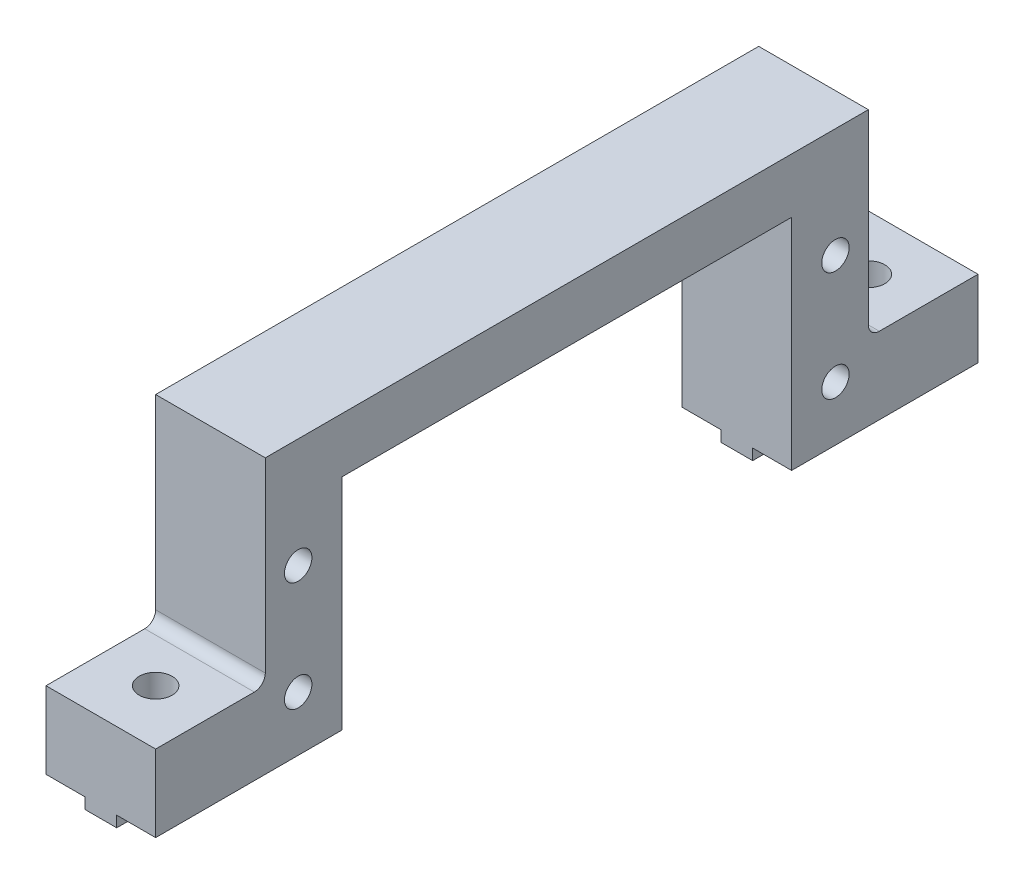
ISO-10303-21;
HEADER;
FILE_DESCRIPTION(('STEP AP214'),'2;1');
FILE_NAME('part.step','',(''),(''),'','','');
FILE_SCHEMA(('AUTOMOTIVE_DESIGN { 1 0 10303 214 1 1 1 1 }'));
ENDSEC;
DATA;
#1=APPLICATION_CONTEXT('core data for automotive mechanical design processes');
#2=APPLICATION_PROTOCOL_DEFINITION('international standard','automotive_design',2000,#1);
#3=PRODUCT_CONTEXT('',#1,'mechanical');
#4=PRODUCT('Part','Part','',(#3));
#5=PRODUCT_RELATED_PRODUCT_CATEGORY('part','',(#4));
#6=PRODUCT_DEFINITION_FORMATION('','',#4);
#7=PRODUCT_DEFINITION_CONTEXT('part definition',#1,'design');
#8=PRODUCT_DEFINITION('design','',#6,#7);
#9=PRODUCT_DEFINITION_SHAPE('','',#8);
#10=(LENGTH_UNIT() NAMED_UNIT(*) SI_UNIT(.MILLI.,.METRE.));
#11=(NAMED_UNIT(*) PLANE_ANGLE_UNIT() SI_UNIT($,.RADIAN.));
#12=(NAMED_UNIT(*) SI_UNIT($,.STERADIAN.) SOLID_ANGLE_UNIT());
#13=UNCERTAINTY_MEASURE_WITH_UNIT(LENGTH_MEASURE(1.E-05),#10,'distance_accuracy_value','');
#14=(GEOMETRIC_REPRESENTATION_CONTEXT(3) GLOBAL_UNCERTAINTY_ASSIGNED_CONTEXT((#13)) GLOBAL_UNIT_ASSIGNED_CONTEXT((#10,
#11,#12)) REPRESENTATION_CONTEXT('',''));
#15=CARTESIAN_POINT('',(0.,0.,0.));
#16=DIRECTION('',(0.,0.,1.));
#17=DIRECTION('',(1.,0.,0.));
#18=AXIS2_PLACEMENT_3D('',#15,#16,#17);
#19=CARTESIAN_POINT('',(-1.45,-1.,37.5));
#20=DIRECTION('',(1.,0.,0.));
#21=DIRECTION('',(0.,0.,-1.));
#22=AXIS2_PLACEMENT_3D('',#19,#20,#21);
#23=PLANE('',#22);
#24=DIRECTION('',(0.,0.,-1.));
#25=VECTOR('',#24,1.);
#26=CARTESIAN_POINT('',(-1.45,-1.,37.5));
#27=LINE('',#26,#25);
#28=CARTESIAN_POINT('',(-1.45,-1.,32.1159427126066));
#29=VERTEX_POINT('',#28);
#30=CARTESIAN_POINT('',(-1.45,-1.,20.5));
#31=VERTEX_POINT('',#30);
#32=EDGE_CURVE('E261',#29,#31,#27,.T.);
#33=ORIENTED_EDGE('',*,*,#32,.F.);
#34=DIRECTION('',(0.,1.,0.));
#35=VECTOR('',#34,1.);
#36=CARTESIAN_POINT('',(-1.45,-1.,32.1159427126066));
#37=LINE('',#36,#35);
#38=CARTESIAN_POINT('',(-1.45,0.,32.1159427126066));
#39=VERTEX_POINT('',#38);
#40=EDGE_CURVE('E455',#29,#39,#37,.T.);
#41=ORIENTED_EDGE('',*,*,#40,.T.);
#42=DIRECTION('',(0.,0.,-1.));
#43=VECTOR('',#42,1.);
#44=CARTESIAN_POINT('',(-1.45,0.,37.5));
#45=LINE('',#44,#43);
#46=CARTESIAN_POINT('',(-1.45,0.,20.5));
#47=VERTEX_POINT('',#46);
#48=EDGE_CURVE('E514',#39,#47,#45,.T.);
#49=ORIENTED_EDGE('',*,*,#48,.T.);
#50=DIRECTION('',(0.,-1.,0.));
#51=VECTOR('',#50,1.);
#52=CARTESIAN_POINT('',(-1.45,-1.,20.5));
#53=LINE('',#52,#51);
#54=EDGE_CURVE('E341',#47,#31,#53,.T.);
#55=ORIENTED_EDGE('',*,*,#54,.T.);
#56=EDGE_LOOP('',(#33,#41,#49,#55));
#57=FACE_BOUND('',#56,.T.);
#58=ADVANCED_FACE('F33',(#57),#23,.F.);
#59=CARTESIAN_POINT('',(1.45,-1.,37.5));
#60=DIRECTION('',(0.,1.,0.));
#61=DIRECTION('',(-1.,0.,0.));
#62=AXIS2_PLACEMENT_3D('',#59,#60,#61);
#63=PLANE('',#62);
#64=CARTESIAN_POINT('',(-1.45,-1.,37.5));
#65=VERTEX_POINT('',#64);
#66=CARTESIAN_POINT('',(-1.45,-1.,32.8840572873934));
#67=VERTEX_POINT('',#66);
#68=EDGE_CURVE('E249',#65,#67,#27,.T.);
#69=ORIENTED_EDGE('',*,*,#68,.T.);
#70=CARTESIAN_POINT('',(0.,-1.,32.5));
#71=DIRECTION('',(0.,1.,0.));
#72=DIRECTION('',(0.,0.,1.));
#73=AXIS2_PLACEMENT_3D('',#70,#71,#72);
#74=CIRCLE('',#73,1.5);
#75=CARTESIAN_POINT('',(1.45,-1.,32.8840572873934));
#76=VERTEX_POINT('',#75);
#77=EDGE_CURVE('E230',#67,#76,#74,.T.);
#78=ORIENTED_EDGE('',*,*,#77,.T.);
#79=DIRECTION('',(0.,0.,-1.));
#80=VECTOR('',#79,1.);
#81=CARTESIAN_POINT('',(1.45,-1.,37.5));
#82=LINE('',#81,#80);
#83=CARTESIAN_POINT('',(1.45,-1.,37.5));
#84=VERTEX_POINT('',#83);
#85=EDGE_CURVE('E246',#84,#76,#82,.T.);
#86=ORIENTED_EDGE('',*,*,#85,.F.);
#87=DIRECTION('',(1.,0.,0.));
#88=VECTOR('',#87,1.);
#89=CARTESIAN_POINT('',(1.45,-1.,37.5));
#90=LINE('',#89,#88);
#91=EDGE_CURVE('E333',#65,#84,#90,.T.);
#92=ORIENTED_EDGE('',*,*,#91,.F.);
#93=EDGE_LOOP('',(#69,#78,#86,#92));
#94=FACE_BOUND('',#93,.T.);
#95=ADVANCED_FACE('F244',(#94),#63,.F.);
#96=CARTESIAN_POINT('',(1.45,0.,37.5));
#97=DIRECTION('',(-1.,0.,0.));
#98=DIRECTION('',(0.,0.,1.));
#99=AXIS2_PLACEMENT_3D('',#96,#97,#98);
#100=PLANE('',#99);
#101=ORIENTED_EDGE('',*,*,#85,.T.);
#102=DIRECTION('',(0.,1.,0.));
#103=VECTOR('',#102,1.);
#104=CARTESIAN_POINT('',(1.45,-1.,32.8840572873934));
#105=LINE('',#104,#103);
#106=CARTESIAN_POINT('',(1.45,0.,32.8840572873934));
#107=VERTEX_POINT('',#106);
#108=EDGE_CURVE('E227',#76,#107,#105,.T.);
#109=ORIENTED_EDGE('',*,*,#108,.T.);
#110=DIRECTION('',(0.,0.,-1.));
#111=VECTOR('',#110,1.);
#112=CARTESIAN_POINT('',(1.45,0.,37.5));
#113=LINE('',#112,#111);
#114=CARTESIAN_POINT('',(1.45,0.,37.5));
#115=VERTEX_POINT('',#114);
#116=EDGE_CURVE('E269',#115,#107,#113,.T.);
#117=ORIENTED_EDGE('',*,*,#116,.F.);
#118=DIRECTION('',(0.,1.,0.));
#119=VECTOR('',#118,1.);
#120=CARTESIAN_POINT('',(1.45,0.,37.5));
#121=LINE('',#120,#119);
#122=EDGE_CURVE('E254',#84,#115,#121,.T.);
#123=ORIENTED_EDGE('',*,*,#122,.F.);
#124=EDGE_LOOP('',(#101,#109,#117,#123));
#125=FACE_BOUND('',#124,.T.);
#126=ADVANCED_FACE('F253',(#125),#100,.F.);
#127=CARTESIAN_POINT('',(-1.45,-1.,-32.8840572873934));
#128=VERTEX_POINT('',#127);
#129=CARTESIAN_POINT('',(-1.45,-1.,-37.5));
#130=VERTEX_POINT('',#129);
#131=EDGE_CURVE('E255',#128,#130,#27,.T.);
#132=ORIENTED_EDGE('',*,*,#131,.F.);
#133=DIRECTION('',(0.,1.,0.));
#134=VECTOR('',#133,1.);
#135=CARTESIAN_POINT('',(-1.45,-1.,-32.8840572873934));
#136=LINE('',#135,#134);
#137=CARTESIAN_POINT('',(-1.45,0.,-32.8840572873934));
#138=VERTEX_POINT('',#137);
#139=EDGE_CURVE('E430',#128,#138,#136,.T.);
#140=ORIENTED_EDGE('',*,*,#139,.T.);
#141=CARTESIAN_POINT('',(-1.45,0.,-37.5));
#142=VERTEX_POINT('',#141);
#143=EDGE_CURVE('E516',#138,#142,#45,.T.);
#144=ORIENTED_EDGE('',*,*,#143,.T.);
#145=DIRECTION('',(0.,-1.,0.));
#146=VECTOR('',#145,1.);
#147=CARTESIAN_POINT('',(-1.45,-1.,-37.5));
#148=LINE('',#147,#146);
#149=EDGE_CURVE('E318',#142,#130,#148,.T.);
#150=ORIENTED_EDGE('',*,*,#149,.T.);
#151=EDGE_LOOP('',(#132,#140,#144,#150));
#152=FACE_BOUND('',#151,.T.);
#153=ADVANCED_FACE('F534',(#152),#23,.F.);
#154=CARTESIAN_POINT('',(-1.45,-1.,-20.5));
#155=VERTEX_POINT('',#154);
#156=CARTESIAN_POINT('',(-1.45,-1.,-32.1159427126066));
#157=VERTEX_POINT('',#156);
#158=EDGE_CURVE('E259',#155,#157,#27,.T.);
#159=ORIENTED_EDGE('',*,*,#158,.T.);
#160=CARTESIAN_POINT('',(0.,-1.,-32.5));
#161=DIRECTION('',(0.,1.,0.));
#162=DIRECTION('',(0.,0.,1.));
#163=AXIS2_PLACEMENT_3D('',#160,#161,#162);
#164=CIRCLE('',#163,1.5);
#165=CARTESIAN_POINT('',(1.45,-1.,-32.1159427126066));
#166=VERTEX_POINT('',#165);
#167=EDGE_CURVE('E454',#157,#166,#164,.T.);
#168=ORIENTED_EDGE('',*,*,#167,.T.);
#169=CARTESIAN_POINT('',(1.45,-1.,-20.5));
#170=VERTEX_POINT('',#169);
#171=EDGE_CURVE('E258',#170,#166,#82,.T.);
#172=ORIENTED_EDGE('',*,*,#171,.F.);
#173=DIRECTION('',(-1.,0.,0.));
#174=VECTOR('',#173,1.);
#175=CARTESIAN_POINT('',(5.,-1.,-20.5));
#176=LINE('',#175,#174);
#177=EDGE_CURVE('E366',#170,#155,#176,.T.);
#178=ORIENTED_EDGE('',*,*,#177,.T.);
#179=EDGE_LOOP('',(#159,#168,#172,#178));
#180=FACE_BOUND('',#179,.T.);
#181=ADVANCED_FACE('F520',(#180),#63,.F.);
#182=ORIENTED_EDGE('',*,*,#171,.T.);
#183=DIRECTION('',(0.,1.,0.));
#184=VECTOR('',#183,1.);
#185=CARTESIAN_POINT('',(1.45,-1.,-32.1159427126066));
#186=LINE('',#185,#184);
#187=CARTESIAN_POINT('',(1.45,0.,-32.1159427126066));
#188=VERTEX_POINT('',#187);
#189=EDGE_CURVE('E444',#166,#188,#186,.T.);
#190=ORIENTED_EDGE('',*,*,#189,.T.);
#191=CARTESIAN_POINT('',(1.45,0.,-20.5));
#192=VERTEX_POINT('',#191);
#193=EDGE_CURVE('E276',#192,#188,#113,.T.);
#194=ORIENTED_EDGE('',*,*,#193,.F.);
#195=DIRECTION('',(0.,-1.,0.));
#196=VECTOR('',#195,1.);
#197=CARTESIAN_POINT('',(1.45,0.,-20.5));
#198=LINE('',#197,#196);
#199=EDGE_CURVE('E356',#192,#170,#198,.T.);
#200=ORIENTED_EDGE('',*,*,#199,.T.);
#201=EDGE_LOOP('',(#182,#190,#194,#200));
#202=FACE_BOUND('',#201,.T.);
#203=ADVANCED_FACE('F553',(#202),#100,.F.);
#204=CARTESIAN_POINT('',(-1.45,0.,37.5));
#205=DIRECTION('',(0.,1.,0.));
#206=DIRECTION('',(-1.,0.,0.));
#207=AXIS2_PLACEMENT_3D('',#204,#205,#206);
#208=PLANE('',#207);
#209=ORIENTED_EDGE('',*,*,#48,.F.);
#210=CARTESIAN_POINT('',(0.,0.,32.5));
#211=DIRECTION('',(0.,1.,0.));
#212=DIRECTION('',(-1.,0.,0.));
#213=AXIS2_PLACEMENT_3D('',#210,#211,#212);
#214=CIRCLE('',#213,1.5);
#215=CARTESIAN_POINT('',(-1.45,0.,32.8840572873934));
#216=VERTEX_POINT('',#215);
#217=EDGE_CURVE('E460',#39,#216,#214,.T.);
#218=ORIENTED_EDGE('',*,*,#217,.T.);
#219=CARTESIAN_POINT('',(-1.45,0.,37.5));
#220=VERTEX_POINT('',#219);
#221=EDGE_CURVE('E510',#220,#216,#45,.T.);
#222=ORIENTED_EDGE('',*,*,#221,.F.);
#223=DIRECTION('',(1.,0.,0.));
#224=VECTOR('',#223,1.);
#225=CARTESIAN_POINT('',(-1.45,0.,37.5));
#226=LINE('',#225,#224);
#227=CARTESIAN_POINT('',(-5.,0.,37.5));
#228=VERTEX_POINT('',#227);
#229=EDGE_CURVE('E308',#228,#220,#226,.T.);
#230=ORIENTED_EDGE('',*,*,#229,.F.);
#231=DIRECTION('',(0.,0.,-1.));
#232=VECTOR('',#231,1.);
#233=CARTESIAN_POINT('',(-5.,0.,37.5));
#234=LINE('',#233,#232);
#235=CARTESIAN_POINT('',(-5.,0.,20.5));
#236=VERTEX_POINT('',#235);
#237=EDGE_CURVE('E302',#228,#236,#234,.T.);
#238=ORIENTED_EDGE('',*,*,#237,.T.);
#239=DIRECTION('',(1.,0.,0.));
#240=VECTOR('',#239,1.);
#241=CARTESIAN_POINT('',(-1.45,0.,20.5));
#242=LINE('',#241,#240);
#243=EDGE_CURVE('E324',#236,#47,#242,.T.);
#244=ORIENTED_EDGE('',*,*,#243,.T.);
#245=EDGE_LOOP('',(#209,#218,#222,#230,#238,#244));
#246=FACE_BOUND('',#245,.T.);
#247=ADVANCED_FACE('F555',(#246),#208,.F.);
#248=ORIENTED_EDGE('',*,*,#221,.T.);
#249=DIRECTION('',(0.,1.,0.));
#250=VECTOR('',#249,1.);
#251=CARTESIAN_POINT('',(-1.45,-1.,32.8840572873934));
#252=LINE('',#251,#250);
#253=EDGE_CURVE('E238',#216,#67,#252,.F.);
#254=ORIENTED_EDGE('',*,*,#253,.T.);
#255=ORIENTED_EDGE('',*,*,#68,.F.);
#256=DIRECTION('',(0.,-1.,0.));
#257=VECTOR('',#256,1.);
#258=CARTESIAN_POINT('',(-1.45,-1.,37.5));
#259=LINE('',#258,#257);
#260=EDGE_CURVE('E335',#220,#65,#259,.T.);
#261=ORIENTED_EDGE('',*,*,#260,.F.);
#262=EDGE_LOOP('',(#248,#254,#255,#261));
#263=FACE_BOUND('',#262,.T.);
#264=ADVANCED_FACE('F562',(#263),#23,.F.);
#265=CARTESIAN_POINT('',(1.45,-1.,32.1159427126066));
#266=VERTEX_POINT('',#265);
#267=CARTESIAN_POINT('',(1.45,-1.,20.5));
#268=VERTEX_POINT('',#267);
#269=EDGE_CURVE('E256',#266,#268,#82,.T.);
#270=ORIENTED_EDGE('',*,*,#269,.F.);
#271=EDGE_CURVE('E250',#266,#29,#74,.T.);
#272=ORIENTED_EDGE('',*,*,#271,.T.);
#273=ORIENTED_EDGE('',*,*,#32,.T.);
#274=DIRECTION('',(-1.,0.,0.));
#275=VECTOR('',#274,1.);
#276=CARTESIAN_POINT('',(5.,-1.,20.5));
#277=LINE('',#276,#275);
#278=EDGE_CURVE('E360',#268,#31,#277,.T.);
#279=ORIENTED_EDGE('',*,*,#278,.F.);
#280=EDGE_LOOP('',(#270,#272,#273,#279));
#281=FACE_BOUND('',#280,.T.);
#282=ADVANCED_FACE('F566',(#281),#63,.F.);
#283=CARTESIAN_POINT('',(1.45,0.,32.1159427126066));
#284=VERTEX_POINT('',#283);
#285=CARTESIAN_POINT('',(1.45,0.,20.5));
#286=VERTEX_POINT('',#285);
#287=EDGE_CURVE('E275',#284,#286,#113,.T.);
#288=ORIENTED_EDGE('',*,*,#287,.F.);
#289=DIRECTION('',(0.,1.,0.));
#290=VECTOR('',#289,1.);
#291=CARTESIAN_POINT('',(1.45,-1.,32.1159427126066));
#292=LINE('',#291,#290);
#293=EDGE_CURVE('E239',#284,#266,#292,.F.);
#294=ORIENTED_EDGE('',*,*,#293,.T.);
#295=ORIENTED_EDGE('',*,*,#269,.T.);
#296=DIRECTION('',(0.,1.,0.));
#297=VECTOR('',#296,1.);
#298=CARTESIAN_POINT('',(1.45,0.,20.5));
#299=LINE('',#298,#297);
#300=EDGE_CURVE('E344',#268,#286,#299,.T.);
#301=ORIENTED_EDGE('',*,*,#300,.T.);
#302=EDGE_LOOP('',(#288,#294,#295,#301));
#303=FACE_BOUND('',#302,.T.);
#304=ADVANCED_FACE('F557',(#303),#100,.F.);
#305=CARTESIAN_POINT('',(5.,0.,37.5));
#306=DIRECTION('',(0.,1.,0.));
#307=DIRECTION('',(-1.,0.,0.));
#308=AXIS2_PLACEMENT_3D('',#305,#306,#307);
#309=PLANE('',#308);
#310=ORIENTED_EDGE('',*,*,#116,.T.);
#311=CARTESIAN_POINT('',(0.,0.,32.5));
#312=DIRECTION('',(0.,1.,0.));
#313=DIRECTION('',(-1.,0.,0.));
#314=AXIS2_PLACEMENT_3D('',#311,#312,#313);
#315=CIRCLE('',#314,1.5);
#316=EDGE_CURVE('E233',#107,#284,#315,.T.);
#317=ORIENTED_EDGE('',*,*,#316,.T.);
#318=ORIENTED_EDGE('',*,*,#287,.T.);
#319=DIRECTION('',(1.,0.,0.));
#320=VECTOR('',#319,1.);
#321=CARTESIAN_POINT('',(5.,0.,20.5));
#322=LINE('',#321,#320);
#323=CARTESIAN_POINT('',(5.,0.,20.5));
#324=VERTEX_POINT('',#323);
#325=EDGE_CURVE('E347',#286,#324,#322,.T.);
#326=ORIENTED_EDGE('',*,*,#325,.T.);
#327=DIRECTION('',(0.,0.,-1.));
#328=VECTOR('',#327,1.);
#329=CARTESIAN_POINT('',(5.,0.,37.5));
#330=LINE('',#329,#328);
#331=CARTESIAN_POINT('',(5.,0.,37.5));
#332=VERTEX_POINT('',#331);
#333=EDGE_CURVE('E286',#332,#324,#330,.T.);
#334=ORIENTED_EDGE('',*,*,#333,.F.);
#335=DIRECTION('',(1.,0.,0.));
#336=VECTOR('',#335,1.);
#337=CARTESIAN_POINT('',(5.,0.,37.5));
#338=LINE('',#337,#336);
#339=EDGE_CURVE('E330',#115,#332,#338,.T.);
#340=ORIENTED_EDGE('',*,*,#339,.F.);
#341=EDGE_LOOP('',(#310,#317,#318,#326,#334,#340));
#342=FACE_BOUND('',#341,.T.);
#343=ADVANCED_FACE('F569',(#342),#309,.F.);
#344=ORIENTED_EDGE('',*,*,#143,.F.);
#345=CARTESIAN_POINT('',(0.,0.,-32.5));
#346=DIRECTION('',(0.,1.,0.));
#347=DIRECTION('',(-1.,0.,0.));
#348=AXIS2_PLACEMENT_3D('',#345,#346,#347);
#349=CIRCLE('',#348,1.5);
#350=CARTESIAN_POINT('',(-1.45,0.,-32.1159427126066));
#351=VERTEX_POINT('',#350);
#352=EDGE_CURVE('E438',#138,#351,#349,.T.);
#353=ORIENTED_EDGE('',*,*,#352,.T.);
#354=CARTESIAN_POINT('',(-1.45,0.,-20.5));
#355=VERTEX_POINT('',#354);
#356=EDGE_CURVE('E515',#355,#351,#45,.T.);
#357=ORIENTED_EDGE('',*,*,#356,.F.);
#358=DIRECTION('',(-1.,0.,0.));
#359=VECTOR('',#358,1.);
#360=CARTESIAN_POINT('',(-1.45,0.,-20.5));
#361=LINE('',#360,#359);
#362=CARTESIAN_POINT('',(-5.,0.,-20.5));
#363=VERTEX_POINT('',#362);
#364=EDGE_CURVE('E350',#355,#363,#361,.T.);
#365=ORIENTED_EDGE('',*,*,#364,.T.);
#366=CARTESIAN_POINT('',(-5.,0.,-37.5));
#367=VERTEX_POINT('',#366);
#368=EDGE_CURVE('E305',#363,#367,#234,.T.);
#369=ORIENTED_EDGE('',*,*,#368,.T.);
#370=DIRECTION('',(1.,0.,0.));
#371=VECTOR('',#370,1.);
#372=CARTESIAN_POINT('',(-1.45,0.,-37.5));
#373=LINE('',#372,#371);
#374=EDGE_CURVE('E321',#367,#142,#373,.T.);
#375=ORIENTED_EDGE('',*,*,#374,.T.);
#376=EDGE_LOOP('',(#344,#353,#357,#365,#369,#375));
#377=FACE_BOUND('',#376,.T.);
#378=ADVANCED_FACE('F528',(#377),#208,.F.);
#379=ORIENTED_EDGE('',*,*,#356,.T.);
#380=DIRECTION('',(0.,1.,0.));
#381=VECTOR('',#380,1.);
#382=CARTESIAN_POINT('',(-1.45,-1.,-32.1159427126066));
#383=LINE('',#382,#381);
#384=EDGE_CURVE('E441',#351,#157,#383,.F.);
#385=ORIENTED_EDGE('',*,*,#384,.T.);
#386=ORIENTED_EDGE('',*,*,#158,.F.);
#387=DIRECTION('',(0.,1.,0.));
#388=VECTOR('',#387,1.);
#389=CARTESIAN_POINT('',(-1.45,-0.999999999999991,-20.5));
#390=LINE('',#389,#388);
#391=EDGE_CURVE('E353',#155,#355,#390,.T.);
#392=ORIENTED_EDGE('',*,*,#391,.T.);
#393=EDGE_LOOP('',(#379,#385,#386,#392));
#394=FACE_BOUND('',#393,.T.);
#395=ADVANCED_FACE('F523',(#394),#23,.F.);
#396=CARTESIAN_POINT('',(1.45,-1.,-32.8840572873934));
#397=VERTEX_POINT('',#396);
#398=CARTESIAN_POINT('',(1.45,-1.,-37.5));
#399=VERTEX_POINT('',#398);
#400=EDGE_CURVE('E262',#397,#399,#82,.T.);
#401=ORIENTED_EDGE('',*,*,#400,.F.);
#402=EDGE_CURVE('E450',#397,#128,#164,.T.);
#403=ORIENTED_EDGE('',*,*,#402,.T.);
#404=ORIENTED_EDGE('',*,*,#131,.T.);
#405=DIRECTION('',(1.,0.,0.));
#406=VECTOR('',#405,1.);
#407=CARTESIAN_POINT('',(1.45,-1.,-37.5));
#408=LINE('',#407,#406);
#409=EDGE_CURVE('E316',#130,#399,#408,.T.);
#410=ORIENTED_EDGE('',*,*,#409,.T.);
#411=EDGE_LOOP('',(#401,#403,#404,#410));
#412=FACE_BOUND('',#411,.T.);
#413=ADVANCED_FACE('F541',(#412),#63,.F.);
#414=CARTESIAN_POINT('',(1.45,0.,-32.8840572873934));
#415=VERTEX_POINT('',#414);
#416=CARTESIAN_POINT('',(1.45,0.,-37.5));
#417=VERTEX_POINT('',#416);
#418=EDGE_CURVE('E279',#415,#417,#113,.T.);
#419=ORIENTED_EDGE('',*,*,#418,.F.);
#420=DIRECTION('',(0.,1.,0.));
#421=VECTOR('',#420,1.);
#422=CARTESIAN_POINT('',(1.45,-1.,-32.8840572873934));
#423=LINE('',#422,#421);
#424=EDGE_CURVE('E446',#415,#397,#423,.F.);
#425=ORIENTED_EDGE('',*,*,#424,.T.);
#426=ORIENTED_EDGE('',*,*,#400,.T.);
#427=DIRECTION('',(0.,1.,0.));
#428=VECTOR('',#427,1.);
#429=CARTESIAN_POINT('',(1.45,0.,-37.5));
#430=LINE('',#429,#428);
#431=EDGE_CURVE('E314',#399,#417,#430,.T.);
#432=ORIENTED_EDGE('',*,*,#431,.T.);
#433=EDGE_LOOP('',(#419,#425,#426,#432));
#434=FACE_BOUND('',#433,.T.);
#435=ADVANCED_FACE('F543',(#434),#100,.F.);
#436=ORIENTED_EDGE('',*,*,#193,.T.);
#437=CARTESIAN_POINT('',(0.,0.,-32.5));
#438=DIRECTION('',(0.,1.,0.));
#439=DIRECTION('',(-1.,0.,0.));
#440=AXIS2_PLACEMENT_3D('',#437,#438,#439);
#441=CIRCLE('',#440,1.5);
#442=EDGE_CURVE('E448',#188,#415,#441,.T.);
#443=ORIENTED_EDGE('',*,*,#442,.T.);
#444=ORIENTED_EDGE('',*,*,#418,.T.);
#445=DIRECTION('',(1.,0.,0.));
#446=VECTOR('',#445,1.);
#447=CARTESIAN_POINT('',(5.,0.,-37.5));
#448=LINE('',#447,#446);
#449=CARTESIAN_POINT('',(5.,0.,-37.5));
#450=VERTEX_POINT('',#449);
#451=EDGE_CURVE('E312',#417,#450,#448,.T.);
#452=ORIENTED_EDGE('',*,*,#451,.T.);
#453=CARTESIAN_POINT('',(5.,0.,-20.5));
#454=VERTEX_POINT('',#453);
#455=EDGE_CURVE('E290',#454,#450,#330,.T.);
#456=ORIENTED_EDGE('',*,*,#455,.F.);
#457=DIRECTION('',(-1.,0.,0.));
#458=VECTOR('',#457,1.);
#459=CARTESIAN_POINT('',(5.,0.,-20.5));
#460=LINE('',#459,#458);
#461=EDGE_CURVE('E358',#454,#192,#460,.T.);
#462=ORIENTED_EDGE('',*,*,#461,.T.);
#463=EDGE_LOOP('',(#436,#443,#444,#452,#456,#462));
#464=FACE_BOUND('',#463,.T.);
#465=ADVANCED_FACE('F546',(#464),#309,.F.);
#466=CARTESIAN_POINT('',(5.,25.,37.5));
#467=DIRECTION('',(-1.,0.,0.));
#468=DIRECTION('',(0.,-1.,0.));
#469=AXIS2_PLACEMENT_3D('',#466,#467,#468);
#470=PLANE('',#469);
#471=CARTESIAN_POINT('',(5.,5.,24.5));
#472=DIRECTION('',(1.,0.,0.));
#473=DIRECTION('',(0.,0.,-1.));
#474=AXIS2_PLACEMENT_3D('',#471,#472,#473);
#475=CIRCLE('',#474,1.25);
#476=CARTESIAN_POINT('',(5.,5.,23.25));
#477=VERTEX_POINT('',#476);
#478=EDGE_CURVE('E399',#477,#477,#475,.T.);
#479=ORIENTED_EDGE('',*,*,#478,.F.);
#480=EDGE_LOOP('',(#479));
#481=FACE_BOUND('',#480,.T.);
#482=CARTESIAN_POINT('',(5.,15.,24.5));
#483=DIRECTION('',(1.,0.,0.));
#484=DIRECTION('',(0.,0.,-1.));
#485=AXIS2_PLACEMENT_3D('',#482,#483,#484);
#486=CIRCLE('',#485,1.25);
#487=CARTESIAN_POINT('',(5.,15.,23.25));
#488=VERTEX_POINT('',#487);
#489=EDGE_CURVE('E393',#488,#488,#486,.T.);
#490=ORIENTED_EDGE('',*,*,#489,.F.);
#491=EDGE_LOOP('',(#490));
#492=FACE_BOUND('',#491,.T.);
#493=CARTESIAN_POINT('',(5.,5.,-24.5));
#494=DIRECTION('',(-1.,0.,0.));
#495=DIRECTION('',(0.,0.,1.));
#496=AXIS2_PLACEMENT_3D('',#493,#494,#495);
#497=CIRCLE('',#496,1.25);
#498=CARTESIAN_POINT('',(5.,5.,-23.25));
#499=VERTEX_POINT('',#498);
#500=EDGE_CURVE('E387',#499,#499,#497,.T.);
#501=ORIENTED_EDGE('',*,*,#500,.T.);
#502=EDGE_LOOP('',(#501));
#503=FACE_BOUND('',#502,.T.);
#504=CARTESIAN_POINT('',(5.,15.,-24.5));
#505=DIRECTION('',(-1.,0.,0.));
#506=DIRECTION('',(0.,0.,1.));
#507=AXIS2_PLACEMENT_3D('',#504,#505,#506);
#508=CIRCLE('',#507,1.25);
#509=CARTESIAN_POINT('',(5.,15.,-23.25));
#510=VERTEX_POINT('',#509);
#511=EDGE_CURVE('E377',#510,#510,#508,.T.);
#512=ORIENTED_EDGE('',*,*,#511,.T.);
#513=EDGE_LOOP('',(#512));
#514=FACE_BOUND('',#513,.T.);
#515=DIRECTION('',(0.,0.,-1.));
#516=VECTOR('',#515,1.);
#517=CARTESIAN_POINT('',(5.,25.,37.5));
#518=LINE('',#517,#516);
#519=CARTESIAN_POINT('',(5.,25.,27.5));
#520=VERTEX_POINT('',#519);
#521=CARTESIAN_POINT('',(5.,25.,-27.5));
#522=VERTEX_POINT('',#521);
#523=EDGE_CURVE('E295',#520,#522,#518,.T.);
#524=ORIENTED_EDGE('',*,*,#523,.F.);
#525=DIRECTION('',(0.,1.,0.));
#526=VECTOR('',#525,1.);
#527=CARTESIAN_POINT('',(5.,7.,27.5));
#528=LINE('',#527,#526);
#529=CARTESIAN_POINT('',(5.,8.,27.5));
#530=VERTEX_POINT('',#529);
#531=EDGE_CURVE('E422',#530,#520,#528,.T.);
#532=ORIENTED_EDGE('',*,*,#531,.F.);
#533=CARTESIAN_POINT('',(5.,8.,28.5));
#534=DIRECTION('',(-1.,0.,0.));
#535=DIRECTION('',(0.,-1.,0.));
#536=AXIS2_PLACEMENT_3D('',#533,#534,#535);
#537=CIRCLE('',#536,1.);
#538=CARTESIAN_POINT('',(5.,7.,28.5));
#539=VERTEX_POINT('',#538);
#540=EDGE_CURVE('E11',#530,#539,#537,.T.);
#541=ORIENTED_EDGE('',*,*,#540,.T.);
#542=DIRECTION('',(0.,0.,-1.));
#543=VECTOR('',#542,1.);
#544=CARTESIAN_POINT('',(5.,7.,37.5));
#545=LINE('',#544,#543);
#546=CARTESIAN_POINT('',(5.,7.,37.5));
#547=VERTEX_POINT('',#546);
#548=EDGE_CURVE('E424',#547,#539,#545,.T.);
#549=ORIENTED_EDGE('',*,*,#548,.F.);
#550=DIRECTION('',(0.,1.,0.));
#551=VECTOR('',#550,1.);
#552=CARTESIAN_POINT('',(5.,25.,37.5));
#553=LINE('',#552,#551);
#554=EDGE_CURVE('E327',#332,#547,#553,.T.);
#555=ORIENTED_EDGE('',*,*,#554,.F.);
#556=ORIENTED_EDGE('',*,*,#333,.T.);
#557=DIRECTION('',(0.,1.,0.));
#558=VECTOR('',#557,1.);
#559=CARTESIAN_POINT('',(5.,20.,20.5));
#560=LINE('',#559,#558);
#561=CARTESIAN_POINT('',(5.,20.,20.5));
#562=VERTEX_POINT('',#561);
#563=EDGE_CURVE('E373',#324,#562,#560,.T.);
#564=ORIENTED_EDGE('',*,*,#563,.T.);
#565=DIRECTION('',(0.,0.,-1.));
#566=VECTOR('',#565,1.);
#567=CARTESIAN_POINT('',(5.,20.,20.5));
#568=LINE('',#567,#566);
#569=CARTESIAN_POINT('',(5.,20.,-20.5));
#570=VERTEX_POINT('',#569);
#571=EDGE_CURVE('E380',#562,#570,#568,.T.);
#572=ORIENTED_EDGE('',*,*,#571,.T.);
#573=DIRECTION('',(0.,-1.,0.));
#574=VECTOR('',#573,1.);
#575=CARTESIAN_POINT('',(5.,20.,-20.5));
#576=LINE('',#575,#574);
#577=EDGE_CURVE('E364',#570,#454,#576,.T.);
#578=ORIENTED_EDGE('',*,*,#577,.T.);
#579=ORIENTED_EDGE('',*,*,#455,.T.);
#580=DIRECTION('',(0.,1.,0.));
#581=VECTOR('',#580,1.);
#582=CARTESIAN_POINT('',(5.,25.,-37.5));
#583=LINE('',#582,#581);
#584=CARTESIAN_POINT('',(5.,7.,-37.5));
#585=VERTEX_POINT('',#584);
#586=EDGE_CURVE('E309',#450,#585,#583,.T.);
#587=ORIENTED_EDGE('',*,*,#586,.T.);
#588=DIRECTION('',(0.,0.,-1.));
#589=VECTOR('',#588,1.);
#590=CARTESIAN_POINT('',(5.,7.,-37.5));
#591=LINE('',#590,#589);
#592=CARTESIAN_POINT('',(5.,7.,-28.5));
#593=VERTEX_POINT('',#592);
#594=EDGE_CURVE('E415',#593,#585,#591,.T.);
#595=ORIENTED_EDGE('',*,*,#594,.F.);
#596=CARTESIAN_POINT('',(5.,8.,-28.5));
#597=DIRECTION('',(-1.,0.,0.));
#598=DIRECTION('',(0.,-1.,0.));
#599=AXIS2_PLACEMENT_3D('',#596,#597,#598);
#600=CIRCLE('',#599,1.);
#601=CARTESIAN_POINT('',(5.,8.,-27.5));
#602=VERTEX_POINT('',#601);
#603=EDGE_CURVE('E486',#593,#602,#600,.T.);
#604=ORIENTED_EDGE('',*,*,#603,.T.);
#605=DIRECTION('',(0.,1.,0.));
#606=VECTOR('',#605,1.);
#607=CARTESIAN_POINT('',(5.,7.,-27.5));
#608=LINE('',#607,#606);
#609=EDGE_CURVE('E405',#602,#522,#608,.T.);
#610=ORIENTED_EDGE('',*,*,#609,.T.);
#611=EDGE_LOOP('',(#524,#532,#541,#549,#555,#556,#564,#572,#578,#579,#587,#595,#604,#610));
#612=FACE_BOUND('',#611,.T.);
#613=ADVANCED_FACE('F548',(#481,#492,#503,#514,#612),#470,.F.);
#614=CARTESIAN_POINT('',(-5.,25.,37.5));
#615=DIRECTION('',(0.,-1.,0.));
#616=DIRECTION('',(0.,0.,-1.));
#617=AXIS2_PLACEMENT_3D('',#614,#615,#616);
#618=PLANE('',#617);
#619=DIRECTION('',(0.,0.,-1.));
#620=VECTOR('',#619,1.);
#621=CARTESIAN_POINT('',(-5.,25.,37.5));
#622=LINE('',#621,#620);
#623=CARTESIAN_POINT('',(-5.,25.,27.5));
#624=VERTEX_POINT('',#623);
#625=CARTESIAN_POINT('',(-5.,25.,-27.5));
#626=VERTEX_POINT('',#625);
#627=EDGE_CURVE('E299',#624,#626,#622,.T.);
#628=ORIENTED_EDGE('',*,*,#627,.F.);
#629=DIRECTION('',(-1.,0.,0.));
#630=VECTOR('',#629,1.);
#631=CARTESIAN_POINT('',(-5.,25.,27.5));
#632=LINE('',#631,#630);
#633=EDGE_CURVE('E426',#520,#624,#632,.T.);
#634=ORIENTED_EDGE('',*,*,#633,.F.);
#635=ORIENTED_EDGE('',*,*,#523,.T.);
#636=DIRECTION('',(1.,0.,0.));
#637=VECTOR('',#636,1.);
#638=CARTESIAN_POINT('',(5.,25.,-27.5));
#639=LINE('',#638,#637);
#640=EDGE_CURVE('E412',#626,#522,#639,.T.);
#641=ORIENTED_EDGE('',*,*,#640,.F.);
#642=EDGE_LOOP('',(#628,#634,#635,#641));
#643=FACE_BOUND('',#642,.T.);
#644=ADVANCED_FACE('F633',(#643),#618,.F.);
#645=CARTESIAN_POINT('',(-5.,0.,37.5));
#646=DIRECTION('',(1.,0.,0.));
#647=DIRECTION('',(0.,0.,-1.));
#648=AXIS2_PLACEMENT_3D('',#645,#646,#647);
#649=PLANE('',#648);
#650=CARTESIAN_POINT('',(-5.,5.,24.5));
#651=DIRECTION('',(1.,0.,0.));
#652=DIRECTION('',(0.,0.,-1.));
#653=AXIS2_PLACEMENT_3D('',#650,#651,#652);
#654=CIRCLE('',#653,1.25);
#655=CARTESIAN_POINT('',(-5.,5.,23.25));
#656=VERTEX_POINT('',#655);
#657=EDGE_CURVE('E402',#656,#656,#654,.T.);
#658=ORIENTED_EDGE('',*,*,#657,.T.);
#659=EDGE_LOOP('',(#658));
#660=FACE_BOUND('',#659,.T.);
#661=CARTESIAN_POINT('',(-5.,15.,24.5));
#662=DIRECTION('',(1.,0.,0.));
#663=DIRECTION('',(0.,0.,-1.));
#664=AXIS2_PLACEMENT_3D('',#661,#662,#663);
#665=CIRCLE('',#664,1.25);
#666=CARTESIAN_POINT('',(-5.,15.,23.25));
#667=VERTEX_POINT('',#666);
#668=EDGE_CURVE('E396',#667,#667,#665,.T.);
#669=ORIENTED_EDGE('',*,*,#668,.T.);
#670=EDGE_LOOP('',(#669));
#671=FACE_BOUND('',#670,.T.);
#672=CARTESIAN_POINT('',(-5.,5.,-24.5));
#673=DIRECTION('',(-1.,0.,0.));
#674=DIRECTION('',(0.,0.,1.));
#675=AXIS2_PLACEMENT_3D('',#672,#673,#674);
#676=CIRCLE('',#675,1.25);
#677=CARTESIAN_POINT('',(-5.,5.,-23.25));
#678=VERTEX_POINT('',#677);
#679=EDGE_CURVE('E390',#678,#678,#676,.T.);
#680=ORIENTED_EDGE('',*,*,#679,.F.);
#681=EDGE_LOOP('',(#680));
#682=FACE_BOUND('',#681,.T.);
#683=CARTESIAN_POINT('',(-5.,15.,-24.5));
#684=DIRECTION('',(-1.,0.,0.));
#685=DIRECTION('',(0.,0.,1.));
#686=AXIS2_PLACEMENT_3D('',#683,#684,#685);
#687=CIRCLE('',#686,1.25);
#688=CARTESIAN_POINT('',(-5.,15.,-23.25));
#689=VERTEX_POINT('',#688);
#690=EDGE_CURVE('E384',#689,#689,#687,.T.);
#691=ORIENTED_EDGE('',*,*,#690,.F.);
#692=EDGE_LOOP('',(#691));
#693=FACE_BOUND('',#692,.T.);
#694=DIRECTION('',(0.,0.,1.));
#695=VECTOR('',#694,1.);
#696=CARTESIAN_POINT('',(-5.,7.,37.5));
#697=LINE('',#696,#695);
#698=CARTESIAN_POINT('',(-5.,7.,28.5));
#699=VERTEX_POINT('',#698);
#700=CARTESIAN_POINT('',(-5.,7.,37.5));
#701=VERTEX_POINT('',#700);
#702=EDGE_CURVE('E429',#699,#701,#697,.T.);
#703=ORIENTED_EDGE('',*,*,#702,.F.);
#704=CARTESIAN_POINT('',(-5.,8.,28.5));
#705=DIRECTION('',(1.,0.,0.));
#706=DIRECTION('',(0.,0.,-1.));
#707=AXIS2_PLACEMENT_3D('',#704,#705,#706);
#708=CIRCLE('',#707,1.);
#709=CARTESIAN_POINT('',(-5.,8.,27.5));
#710=VERTEX_POINT('',#709);
#711=EDGE_CURVE('E41',#699,#710,#708,.T.);
#712=ORIENTED_EDGE('',*,*,#711,.T.);
#713=DIRECTION('',(0.,1.,0.));
#714=VECTOR('',#713,1.);
#715=CARTESIAN_POINT('',(-5.,7.,27.5));
#716=LINE('',#715,#714);
#717=EDGE_CURVE('E416',#710,#624,#716,.T.);
#718=ORIENTED_EDGE('',*,*,#717,.T.);
#719=ORIENTED_EDGE('',*,*,#627,.T.);
#720=DIRECTION('',(0.,1.,0.));
#721=VECTOR('',#720,1.);
#722=CARTESIAN_POINT('',(-5.,7.,-27.5));
#723=LINE('',#722,#721);
#724=CARTESIAN_POINT('',(-5.,8.,-27.5));
#725=VERTEX_POINT('',#724);
#726=EDGE_CURVE('E408',#725,#626,#723,.T.);
#727=ORIENTED_EDGE('',*,*,#726,.F.);
#728=CARTESIAN_POINT('',(-5.,8.,-28.5));
#729=DIRECTION('',(1.,0.,0.));
#730=DIRECTION('',(0.,0.,-1.));
#731=AXIS2_PLACEMENT_3D('',#728,#729,#730);
#732=CIRCLE('',#731,1.);
#733=CARTESIAN_POINT('',(-5.,7.,-28.5));
#734=VERTEX_POINT('',#733);
#735=EDGE_CURVE('E493',#725,#734,#732,.T.);
#736=ORIENTED_EDGE('',*,*,#735,.T.);
#737=DIRECTION('',(0.,0.,1.));
#738=VECTOR('',#737,1.);
#739=CARTESIAN_POINT('',(-5.,7.,-37.5));
#740=LINE('',#739,#738);
#741=CARTESIAN_POINT('',(-5.,7.,-37.5));
#742=VERTEX_POINT('',#741);
#743=EDGE_CURVE('E410',#742,#734,#740,.T.);
#744=ORIENTED_EDGE('',*,*,#743,.F.);
#745=DIRECTION('',(0.,-1.,0.));
#746=VECTOR('',#745,1.);
#747=CARTESIAN_POINT('',(-5.,0.,-37.5));
#748=LINE('',#747,#746);
#749=EDGE_CURVE('E306',#742,#367,#748,.T.);
#750=ORIENTED_EDGE('',*,*,#749,.T.);
#751=ORIENTED_EDGE('',*,*,#368,.F.);
#752=DIRECTION('',(0.,-1.,0.));
#753=VECTOR('',#752,1.);
#754=CARTESIAN_POINT('',(-5.,20.,-20.5));
#755=LINE('',#754,#753);
#756=CARTESIAN_POINT('',(-5.,20.,-20.5));
#757=VERTEX_POINT('',#756);
#758=EDGE_CURVE('E371',#757,#363,#755,.T.);
#759=ORIENTED_EDGE('',*,*,#758,.F.);
#760=DIRECTION('',(0.,0.,-1.));
#761=VECTOR('',#760,1.);
#762=CARTESIAN_POINT('',(-5.,20.,20.5));
#763=LINE('',#762,#761);
#764=CARTESIAN_POINT('',(-5.,20.,20.5));
#765=VERTEX_POINT('',#764);
#766=EDGE_CURVE('E374',#765,#757,#763,.T.);
#767=ORIENTED_EDGE('',*,*,#766,.F.);
#768=DIRECTION('',(0.,-1.,0.));
#769=VECTOR('',#768,1.);
#770=CARTESIAN_POINT('',(-5.,0.,20.5));
#771=LINE('',#770,#769);
#772=EDGE_CURVE('E508',#765,#236,#771,.T.);
#773=ORIENTED_EDGE('',*,*,#772,.T.);
#774=ORIENTED_EDGE('',*,*,#237,.F.);
#775=DIRECTION('',(0.,-1.,0.));
#776=VECTOR('',#775,1.);
#777=CARTESIAN_POINT('',(-5.,0.,37.5));
#778=LINE('',#777,#776);
#779=EDGE_CURVE('E325',#701,#228,#778,.T.);
#780=ORIENTED_EDGE('',*,*,#779,.F.);
#781=EDGE_LOOP('',(#703,#712,#718,#719,#727,#736,#744,#750,#751,#759,#767,#773,#774,#780));
#782=FACE_BOUND('',#781,.T.);
#783=ADVANCED_FACE('F497',(#660,#671,#682,#693,#782),#649,.F.);
#784=CARTESIAN_POINT('',(0.,0.,37.5));
#785=DIRECTION('',(0.,0.,-1.));
#786=DIRECTION('',(-1.,0.,0.));
#787=AXIS2_PLACEMENT_3D('',#784,#785,#786);
#788=PLANE('',#787);
#789=ORIENTED_EDGE('',*,*,#554,.T.);
#790=DIRECTION('',(1.,0.,0.));
#791=VECTOR('',#790,1.);
#792=CARTESIAN_POINT('',(-5.,7.,37.5));
#793=LINE('',#792,#791);
#794=EDGE_CURVE('E433',#701,#547,#793,.T.);
#795=ORIENTED_EDGE('',*,*,#794,.F.);
#796=ORIENTED_EDGE('',*,*,#779,.T.);
#797=ORIENTED_EDGE('',*,*,#229,.T.);
#798=ORIENTED_EDGE('',*,*,#260,.T.);
#799=ORIENTED_EDGE('',*,*,#91,.T.);
#800=ORIENTED_EDGE('',*,*,#122,.T.);
#801=ORIENTED_EDGE('',*,*,#339,.T.);
#802=EDGE_LOOP('',(#789,#795,#796,#797,#798,#799,#800,#801));
#803=FACE_BOUND('',#802,.T.);
#804=ADVANCED_FACE('F605',(#803),#788,.F.);
#805=CARTESIAN_POINT('',(0.,0.,-37.5));
#806=DIRECTION('',(0.,0.,-1.));
#807=DIRECTION('',(-1.,0.,0.));
#808=AXIS2_PLACEMENT_3D('',#805,#806,#807);
#809=PLANE('',#808);
#810=DIRECTION('',(-1.,0.,0.));
#811=VECTOR('',#810,1.);
#812=CARTESIAN_POINT('',(5.,7.,-37.5));
#813=LINE('',#812,#811);
#814=EDGE_CURVE('E419',#585,#742,#813,.T.);
#815=ORIENTED_EDGE('',*,*,#814,.F.);
#816=ORIENTED_EDGE('',*,*,#586,.F.);
#817=ORIENTED_EDGE('',*,*,#451,.F.);
#818=ORIENTED_EDGE('',*,*,#431,.F.);
#819=ORIENTED_EDGE('',*,*,#409,.F.);
#820=ORIENTED_EDGE('',*,*,#149,.F.);
#821=ORIENTED_EDGE('',*,*,#374,.F.);
#822=ORIENTED_EDGE('',*,*,#749,.F.);
#823=EDGE_LOOP('',(#815,#816,#817,#818,#819,#820,#821,#822));
#824=FACE_BOUND('',#823,.T.);
#825=ADVANCED_FACE('F537',(#824),#809,.T.);
#826=CARTESIAN_POINT('',(5.,20.,20.5));
#827=DIRECTION('',(0.,0.,1.));
#828=DIRECTION('',(0.,-1.,0.));
#829=AXIS2_PLACEMENT_3D('',#826,#827,#828);
#830=PLANE('',#829);
#831=ORIENTED_EDGE('',*,*,#772,.F.);
#832=DIRECTION('',(-1.,0.,0.));
#833=VECTOR('',#832,1.);
#834=CARTESIAN_POINT('',(5.,20.,20.5));
#835=LINE('',#834,#833);
#836=EDGE_CURVE('E361',#562,#765,#835,.T.);
#837=ORIENTED_EDGE('',*,*,#836,.F.);
#838=ORIENTED_EDGE('',*,*,#563,.F.);
#839=ORIENTED_EDGE('',*,*,#325,.F.);
#840=ORIENTED_EDGE('',*,*,#300,.F.);
#841=ORIENTED_EDGE('',*,*,#278,.T.);
#842=ORIENTED_EDGE('',*,*,#54,.F.);
#843=ORIENTED_EDGE('',*,*,#243,.F.);
#844=EDGE_LOOP('',(#831,#837,#838,#839,#840,#841,#842,#843));
#845=FACE_BOUND('',#844,.T.);
#846=ADVANCED_FACE('F601',(#845),#830,.F.);
#847=CARTESIAN_POINT('',(5.,20.,-20.5));
#848=DIRECTION('',(0.,0.,-1.));
#849=DIRECTION('',(0.,1.,0.));
#850=AXIS2_PLACEMENT_3D('',#847,#848,#849);
#851=PLANE('',#850);
#852=ORIENTED_EDGE('',*,*,#391,.F.);
#853=ORIENTED_EDGE('',*,*,#177,.F.);
#854=ORIENTED_EDGE('',*,*,#199,.F.);
#855=ORIENTED_EDGE('',*,*,#461,.F.);
#856=ORIENTED_EDGE('',*,*,#577,.F.);
#857=DIRECTION('',(-1.,0.,0.));
#858=VECTOR('',#857,1.);
#859=CARTESIAN_POINT('',(5.,20.,-20.5));
#860=LINE('',#859,#858);
#861=EDGE_CURVE('E363',#570,#757,#860,.T.);
#862=ORIENTED_EDGE('',*,*,#861,.T.);
#863=ORIENTED_EDGE('',*,*,#758,.T.);
#864=ORIENTED_EDGE('',*,*,#364,.F.);
#865=EDGE_LOOP('',(#852,#853,#854,#855,#856,#862,#863,#864));
#866=FACE_BOUND('',#865,.T.);
#867=ADVANCED_FACE('F552',(#866),#851,.F.);
#868=CARTESIAN_POINT('',(5.,20.,20.5));
#869=DIRECTION('',(0.,1.,0.));
#870=DIRECTION('',(0.,0.,1.));
#871=AXIS2_PLACEMENT_3D('',#868,#869,#870);
#872=PLANE('',#871);
#873=ORIENTED_EDGE('',*,*,#766,.T.);
#874=ORIENTED_EDGE('',*,*,#861,.F.);
#875=ORIENTED_EDGE('',*,*,#571,.F.);
#876=ORIENTED_EDGE('',*,*,#836,.T.);
#877=EDGE_LOOP('',(#873,#874,#875,#876));
#878=FACE_BOUND('',#877,.T.);
#879=ADVANCED_FACE('F612',(#878),#872,.F.);
#880=CARTESIAN_POINT('',(5.,15.,-24.5));
#881=DIRECTION('',(-1.,0.,0.));
#882=DIRECTION('',(0.,0.,1.));
#883=AXIS2_PLACEMENT_3D('',#880,#881,#882);
#884=CYLINDRICAL_SURFACE('',#883,1.25);
#885=ORIENTED_EDGE('',*,*,#511,.F.);
#886=EDGE_LOOP('',(#885));
#887=FACE_BOUND('',#886,.T.);
#888=ORIENTED_EDGE('',*,*,#690,.T.);
#889=EDGE_LOOP('',(#888));
#890=FACE_BOUND('',#889,.T.);
#891=ADVANCED_FACE('F614',(#887,#890),#884,.F.);
#892=CARTESIAN_POINT('',(5.,5.,-24.5));
#893=DIRECTION('',(-1.,0.,0.));
#894=DIRECTION('',(0.,0.,1.));
#895=AXIS2_PLACEMENT_3D('',#892,#893,#894);
#896=CYLINDRICAL_SURFACE('',#895,1.25);
#897=ORIENTED_EDGE('',*,*,#500,.F.);
#898=EDGE_LOOP('',(#897));
#899=FACE_BOUND('',#898,.T.);
#900=ORIENTED_EDGE('',*,*,#679,.T.);
#901=EDGE_LOOP('',(#900));
#902=FACE_BOUND('',#901,.T.);
#903=ADVANCED_FACE('F620',(#899,#902),#896,.F.);
#904=CARTESIAN_POINT('',(5.,15.,24.5));
#905=DIRECTION('',(-1.,0.,0.));
#906=DIRECTION('',(0.,0.,1.));
#907=AXIS2_PLACEMENT_3D('',#904,#905,#906);
#908=CYLINDRICAL_SURFACE('',#907,1.25);
#909=ORIENTED_EDGE('',*,*,#489,.T.);
#910=EDGE_LOOP('',(#909));
#911=FACE_BOUND('',#910,.T.);
#912=ORIENTED_EDGE('',*,*,#668,.F.);
#913=EDGE_LOOP('',(#912));
#914=FACE_BOUND('',#913,.T.);
#915=ADVANCED_FACE('F806',(#911,#914),#908,.F.);
#916=CARTESIAN_POINT('',(5.,5.,24.5));
#917=DIRECTION('',(-1.,0.,0.));
#918=DIRECTION('',(0.,0.,1.));
#919=AXIS2_PLACEMENT_3D('',#916,#917,#918);
#920=CYLINDRICAL_SURFACE('',#919,1.25);
#921=ORIENTED_EDGE('',*,*,#478,.T.);
#922=EDGE_LOOP('',(#921));
#923=FACE_BOUND('',#922,.T.);
#924=ORIENTED_EDGE('',*,*,#657,.F.);
#925=EDGE_LOOP('',(#924));
#926=FACE_BOUND('',#925,.T.);
#927=ADVANCED_FACE('F717',(#923,#926),#920,.F.);
#928=CARTESIAN_POINT('',(5.,7.,-27.5));
#929=DIRECTION('',(0.,0.,1.));
#930=DIRECTION('',(1.,0.,0.));
#931=AXIS2_PLACEMENT_3D('',#928,#929,#930);
#932=PLANE('',#931);
#933=ORIENTED_EDGE('',*,*,#609,.F.);
#934=DIRECTION('',(1.,0.,0.));
#935=VECTOR('',#934,1.);
#936=CARTESIAN_POINT('',(-5.,8.,-27.5));
#937=LINE('',#936,#935);
#938=EDGE_CURVE('E484',#602,#725,#937,.F.);
#939=ORIENTED_EDGE('',*,*,#938,.T.);
#940=ORIENTED_EDGE('',*,*,#726,.T.);
#941=ORIENTED_EDGE('',*,*,#640,.T.);
#942=EDGE_LOOP('',(#933,#939,#940,#941));
#943=FACE_BOUND('',#942,.T.);
#944=ADVANCED_FACE('F712',(#943),#932,.F.);
#945=CARTESIAN_POINT('',(0.,7.,0.));
#946=DIRECTION('',(0.,-1.,0.));
#947=DIRECTION('',(0.,0.,-1.));
#948=AXIS2_PLACEMENT_3D('',#945,#946,#947);
#949=PLANE('',#948);
#950=CARTESIAN_POINT('',(0.,7.,-32.5));
#951=DIRECTION('',(0.,1.,0.));
#952=DIRECTION('',(0.,0.,1.));
#953=AXIS2_PLACEMENT_3D('',#950,#951,#952);
#954=CIRCLE('',#953,1.5);
#955=CARTESIAN_POINT('',(0.,7.,-31.));
#956=VERTEX_POINT('',#955);
#957=EDGE_CURVE('E451',#956,#956,#954,.T.);
#958=ORIENTED_EDGE('',*,*,#957,.F.);
#959=EDGE_LOOP('',(#958));
#960=FACE_BOUND('',#959,.T.);
#961=ORIENTED_EDGE('',*,*,#743,.T.);
#962=DIRECTION('',(1.,0.,0.));
#963=VECTOR('',#962,1.);
#964=CARTESIAN_POINT('',(5.,7.,-28.5));
#965=LINE('',#964,#963);
#966=EDGE_CURVE('E488',#734,#593,#965,.T.);
#967=ORIENTED_EDGE('',*,*,#966,.T.);
#968=ORIENTED_EDGE('',*,*,#594,.T.);
#969=ORIENTED_EDGE('',*,*,#814,.T.);
#970=EDGE_LOOP('',(#961,#967,#968,#969));
#971=FACE_BOUND('',#970,.T.);
#972=ADVANCED_FACE('F504',(#960,#971),#949,.F.);
#973=CARTESIAN_POINT('',(-5.,7.,27.5));
#974=DIRECTION('',(0.,0.,-1.));
#975=DIRECTION('',(-1.,0.,0.));
#976=AXIS2_PLACEMENT_3D('',#973,#974,#975);
#977=PLANE('',#976);
#978=ORIENTED_EDGE('',*,*,#717,.F.);
#979=DIRECTION('',(-1.,0.,0.));
#980=VECTOR('',#979,1.);
#981=CARTESIAN_POINT('',(5.,8.,27.5));
#982=LINE('',#981,#980);
#983=EDGE_CURVE('E48',#710,#530,#982,.F.);
#984=ORIENTED_EDGE('',*,*,#983,.T.);
#985=ORIENTED_EDGE('',*,*,#531,.T.);
#986=ORIENTED_EDGE('',*,*,#633,.T.);
#987=EDGE_LOOP('',(#978,#984,#985,#986));
#988=FACE_BOUND('',#987,.T.);
#989=ADVANCED_FACE('F475',(#988),#977,.F.);
#990=CARTESIAN_POINT('',(0.,7.,0.));
#991=DIRECTION('',(0.,-1.,0.));
#992=DIRECTION('',(0.,0.,-1.));
#993=AXIS2_PLACEMENT_3D('',#990,#991,#992);
#994=PLANE('',#993);
#995=CARTESIAN_POINT('',(0.,7.,32.5));
#996=DIRECTION('',(0.,1.,0.));
#997=DIRECTION('',(0.,0.,1.));
#998=AXIS2_PLACEMENT_3D('',#995,#996,#997);
#999=CIRCLE('',#998,1.5);
#1000=CARTESIAN_POINT('',(0.,7.,34.));
#1001=VERTEX_POINT('',#1000);
#1002=EDGE_CURVE('E251',#1001,#1001,#999,.T.);
#1003=ORIENTED_EDGE('',*,*,#1002,.F.);
#1004=EDGE_LOOP('',(#1003));
#1005=FACE_BOUND('',#1004,.T.);
#1006=ORIENTED_EDGE('',*,*,#548,.T.);
#1007=DIRECTION('',(-1.,0.,0.));
#1008=VECTOR('',#1007,1.);
#1009=CARTESIAN_POINT('',(-5.,7.,28.5));
#1010=LINE('',#1009,#1008);
#1011=EDGE_CURVE('E480',#539,#699,#1010,.T.);
#1012=ORIENTED_EDGE('',*,*,#1011,.T.);
#1013=ORIENTED_EDGE('',*,*,#702,.T.);
#1014=ORIENTED_EDGE('',*,*,#794,.T.);
#1015=EDGE_LOOP('',(#1006,#1012,#1013,#1014));
#1016=FACE_BOUND('',#1015,.T.);
#1017=ADVANCED_FACE('F471',(#1005,#1016),#994,.F.);
#1018=CARTESIAN_POINT('',(0.,-1.,-32.5));
#1019=DIRECTION('',(0.,1.,0.));
#1020=DIRECTION('',(0.,0.,1.));
#1021=AXIS2_PLACEMENT_3D('',#1018,#1019,#1020);
#1022=CYLINDRICAL_SURFACE('',#1021,1.5);
#1023=ORIENTED_EDGE('',*,*,#957,.T.);
#1024=EDGE_LOOP('',(#1023));
#1025=FACE_BOUND('',#1024,.T.);
#1026=ORIENTED_EDGE('',*,*,#402,.F.);
#1027=ORIENTED_EDGE('',*,*,#424,.F.);
#1028=ORIENTED_EDGE('',*,*,#442,.F.);
#1029=ORIENTED_EDGE('',*,*,#189,.F.);
#1030=ORIENTED_EDGE('',*,*,#167,.F.);
#1031=ORIENTED_EDGE('',*,*,#384,.F.);
#1032=ORIENTED_EDGE('',*,*,#352,.F.);
#1033=ORIENTED_EDGE('',*,*,#139,.F.);
#1034=EDGE_LOOP('',(#1026,#1027,#1028,#1029,#1030,#1031,#1032,#1033));
#1035=FACE_BOUND('',#1034,.T.);
#1036=ADVANCED_FACE('F474',(#1025,#1035),#1022,.F.);
#1037=CARTESIAN_POINT('',(0.,-1.,32.5));
#1038=DIRECTION('',(0.,1.,0.));
#1039=DIRECTION('',(0.,0.,1.));
#1040=AXIS2_PLACEMENT_3D('',#1037,#1038,#1039);
#1041=CYLINDRICAL_SURFACE('',#1040,1.5);
#1042=ORIENTED_EDGE('',*,*,#1002,.T.);
#1043=EDGE_LOOP('',(#1042));
#1044=FACE_BOUND('',#1043,.T.);
#1045=ORIENTED_EDGE('',*,*,#271,.F.);
#1046=ORIENTED_EDGE('',*,*,#293,.F.);
#1047=ORIENTED_EDGE('',*,*,#316,.F.);
#1048=ORIENTED_EDGE('',*,*,#108,.F.);
#1049=ORIENTED_EDGE('',*,*,#77,.F.);
#1050=ORIENTED_EDGE('',*,*,#253,.F.);
#1051=ORIENTED_EDGE('',*,*,#217,.F.);
#1052=ORIENTED_EDGE('',*,*,#40,.F.);
#1053=EDGE_LOOP('',(#1045,#1046,#1047,#1048,#1049,#1050,#1051,#1052));
#1054=FACE_BOUND('',#1053,.T.);
#1055=ADVANCED_FACE('F229',(#1044,#1054),#1041,.F.);
#1056=CARTESIAN_POINT('',(0.,8.,-28.5));
#1057=DIRECTION('',(-1.,0.,0.));
#1058=DIRECTION('',(0.,0.,1.));
#1059=AXIS2_PLACEMENT_3D('',#1056,#1057,#1058);
#1060=CYLINDRICAL_SURFACE('',#1059,1.);
#1061=ORIENTED_EDGE('',*,*,#735,.F.);
#1062=ORIENTED_EDGE('',*,*,#938,.F.);
#1063=ORIENTED_EDGE('',*,*,#603,.F.);
#1064=ORIENTED_EDGE('',*,*,#966,.F.);
#1065=EDGE_LOOP('',(#1061,#1062,#1063,#1064));
#1066=FACE_BOUND('',#1065,.T.);
#1067=ADVANCED_FACE('F507',(#1066),#1060,.F.);
#1068=CARTESIAN_POINT('',(0.,8.,28.5));
#1069=DIRECTION('',(1.,0.,0.));
#1070=DIRECTION('',(0.,0.,-1.));
#1071=AXIS2_PLACEMENT_3D('',#1068,#1069,#1070);
#1072=CYLINDRICAL_SURFACE('',#1071,1.);
#1073=ORIENTED_EDGE('',*,*,#540,.F.);
#1074=ORIENTED_EDGE('',*,*,#983,.F.);
#1075=ORIENTED_EDGE('',*,*,#711,.F.);
#1076=ORIENTED_EDGE('',*,*,#1011,.F.);
#1077=EDGE_LOOP('',(#1073,#1074,#1075,#1076));
#1078=FACE_BOUND('',#1077,.T.);
#1079=ADVANCED_FACE('F35',(#1078),#1072,.F.);
#1080=CLOSED_SHELL('',(#58,#95,#126,#153,#181,#203,#247,#264,#282,#304,#343,#378,#395,#413,#435,
#465,#613,#644,#783,#804,#825,#846,#867,#879,#891,#903,#915,#927,#944,#972,#989,#1017,#1036,
#1055,#1067,#1079));
#1081=MANIFOLD_SOLID_BREP('B2',#1080);
#1082=ADVANCED_BREP_SHAPE_REPRESENTATION('',(#18,#1081),#14);
#1083=SHAPE_DEFINITION_REPRESENTATION(#9,#1082);
ENDSEC;
END-ISO-10303-21;
